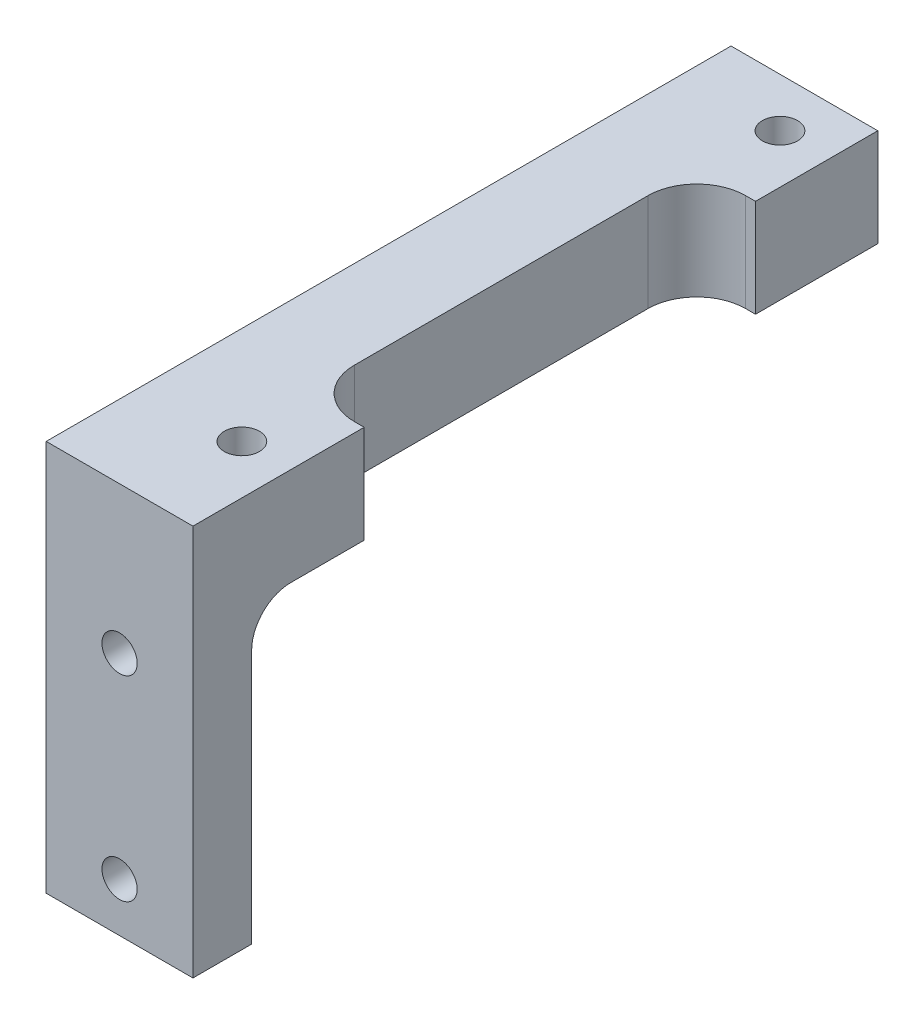
ISO-10303-21;
HEADER;
FILE_DESCRIPTION(('STEP AP214'),'2;1');
FILE_NAME('part.step','',(''),(''),'','','');
FILE_SCHEMA(('AUTOMOTIVE_DESIGN { 1 0 10303 214 1 1 1 1 }'));
ENDSEC;
DATA;
#1=APPLICATION_CONTEXT('core data for automotive mechanical design processes');
#2=APPLICATION_PROTOCOL_DEFINITION('international standard','automotive_design',2000,#1);
#3=PRODUCT_CONTEXT('',#1,'mechanical');
#4=PRODUCT('Part','Part','',(#3));
#5=PRODUCT_RELATED_PRODUCT_CATEGORY('part','',(#4));
#6=PRODUCT_DEFINITION_FORMATION('','',#4);
#7=PRODUCT_DEFINITION_CONTEXT('part definition',#1,'design');
#8=PRODUCT_DEFINITION('design','',#6,#7);
#9=PRODUCT_DEFINITION_SHAPE('','',#8);
#10=(LENGTH_UNIT() NAMED_UNIT(*) SI_UNIT(.MILLI.,.METRE.));
#11=(NAMED_UNIT(*) PLANE_ANGLE_UNIT() SI_UNIT($,.RADIAN.));
#12=(NAMED_UNIT(*) SI_UNIT($,.STERADIAN.) SOLID_ANGLE_UNIT());
#13=UNCERTAINTY_MEASURE_WITH_UNIT(LENGTH_MEASURE(1.E-05),#10,'distance_accuracy_value','');
#14=(GEOMETRIC_REPRESENTATION_CONTEXT(3) GLOBAL_UNCERTAINTY_ASSIGNED_CONTEXT((#13)) GLOBAL_UNIT_ASSIGNED_CONTEXT((#10,
#11,#12)) REPRESENTATION_CONTEXT('',''));
#15=CARTESIAN_POINT('',(0.,0.,0.));
#16=DIRECTION('',(0.,0.,1.));
#17=DIRECTION('',(1.,0.,0.));
#18=AXIS2_PLACEMENT_3D('',#15,#16,#17);
#19=CARTESIAN_POINT('',(-14.2875,-12.7,44.45));
#20=DIRECTION('',(-1.,0.,0.));
#21=DIRECTION('',(0.,0.,1.));
#22=AXIS2_PLACEMENT_3D('',#19,#20,#21);
#23=PLANE('',#22);
#24=DIRECTION('',(0.,0.,-1.));
#25=VECTOR('',#24,1.);
#26=CARTESIAN_POINT('',(-14.2875,6.35,44.45));
#27=LINE('',#26,#25);
#28=CARTESIAN_POINT('',(-14.2875,6.35,38.1));
#29=VERTEX_POINT('',#28);
#30=CARTESIAN_POINT('',(-14.2875,6.35,33.3375));
#31=VERTEX_POINT('',#30);
#32=EDGE_CURVE('E225',#29,#31,#27,.T.);
#33=ORIENTED_EDGE('',*,*,#32,.T.);
#34=DIRECTION('',(0.,1.,0.));
#35=VECTOR('',#34,1.);
#36=CARTESIAN_POINT('',(-14.2875,-12.7,33.3375));
#37=LINE('',#36,#35);
#38=CARTESIAN_POINT('',(-14.2875,12.7,33.3375));
#39=VERTEX_POINT('',#38);
#40=EDGE_CURVE('E161',#31,#39,#37,.T.);
#41=ORIENTED_EDGE('',*,*,#40,.T.);
#42=DIRECTION('',(0.,0.,1.));
#43=VECTOR('',#42,1.);
#44=CARTESIAN_POINT('',(-14.2875,12.7,44.45));
#45=LINE('',#44,#43);
#46=CARTESIAN_POINT('',(-14.2875,12.7,44.45));
#47=VERTEX_POINT('',#46);
#48=EDGE_CURVE('E180',#39,#47,#45,.T.);
#49=ORIENTED_EDGE('',*,*,#48,.T.);
#50=DIRECTION('',(0.,1.,0.));
#51=VECTOR('',#50,1.);
#52=CARTESIAN_POINT('',(-14.2875,-12.7,44.45));
#53=LINE('',#52,#51);
#54=CARTESIAN_POINT('',(-14.2875,-12.7,44.45));
#55=VERTEX_POINT('',#54);
#56=EDGE_CURVE('E189',#55,#47,#53,.T.);
#57=ORIENTED_EDGE('',*,*,#56,.F.);
#58=DIRECTION('',(0.,0.,1.));
#59=VECTOR('',#58,1.);
#60=CARTESIAN_POINT('',(-14.2875,-12.7,44.45));
#61=LINE('',#60,#59);
#62=CARTESIAN_POINT('',(-14.2875,-12.7,40.64));
#63=VERTEX_POINT('',#62);
#64=EDGE_CURVE('E179',#63,#55,#61,.T.);
#65=ORIENTED_EDGE('',*,*,#64,.F.);
#66=DIRECTION('',(0.,1.,0.));
#67=VECTOR('',#66,1.);
#68=CARTESIAN_POINT('',(-14.2875,-12.7,40.64));
#69=LINE('',#68,#67);
#70=CARTESIAN_POINT('',(-14.2875,3.81,40.64));
#71=VERTEX_POINT('',#70);
#72=EDGE_CURVE('E220',#63,#71,#69,.T.);
#73=ORIENTED_EDGE('',*,*,#72,.T.);
#74=CARTESIAN_POINT('',(-14.2875,3.81,38.1));
#75=DIRECTION('',(-1.,0.,0.));
#76=DIRECTION('',(0.,0.,1.));
#77=AXIS2_PLACEMENT_3D('',#74,#75,#76);
#78=CIRCLE('',#77,2.54);
#79=EDGE_CURVE('E242',#71,#29,#78,.T.);
#80=ORIENTED_EDGE('',*,*,#79,.T.);
#81=EDGE_LOOP('',(#33,#41,#49,#57,#65,#73,#80));
#82=FACE_BOUND('',#81,.T.);
#83=ADVANCED_FACE('F43',(#82),#23,.F.);
#84=CARTESIAN_POINT('',(-23.8125,-12.7,44.45));
#85=DIRECTION('',(1.,0.,0.));
#86=DIRECTION('',(0.,0.,-1.));
#87=AXIS2_PLACEMENT_3D('',#84,#85,#86);
#88=PLANE('',#87);
#89=DIRECTION('',(0.,-1.,0.));
#90=VECTOR('',#89,1.);
#91=CARTESIAN_POINT('',(-23.8125,-12.7,0.));
#92=LINE('',#91,#90);
#93=CARTESIAN_POINT('',(-23.8125,12.7,0.));
#94=VERTEX_POINT('',#93);
#95=CARTESIAN_POINT('',(-23.8125,6.35,0.));
#96=VERTEX_POINT('',#95);
#97=EDGE_CURVE('E200',#94,#96,#92,.T.);
#98=ORIENTED_EDGE('',*,*,#97,.T.);
#99=DIRECTION('',(0.,0.,-1.));
#100=VECTOR('',#99,1.);
#101=CARTESIAN_POINT('',(-23.8125,6.35,0.));
#102=LINE('',#101,#100);
#103=CARTESIAN_POINT('',(-23.8125,6.35,38.1));
#104=VERTEX_POINT('',#103);
#105=EDGE_CURVE('E422',#104,#96,#102,.T.);
#106=ORIENTED_EDGE('',*,*,#105,.F.);
#107=CARTESIAN_POINT('',(-23.8125,3.81,38.1));
#108=DIRECTION('',(1.,0.,0.));
#109=DIRECTION('',(0.,0.,-1.));
#110=AXIS2_PLACEMENT_3D('',#107,#108,#109);
#111=CIRCLE('',#110,2.54);
#112=CARTESIAN_POINT('',(-23.8125,3.81,40.64));
#113=VERTEX_POINT('',#112);
#114=EDGE_CURVE('E239',#104,#113,#111,.T.);
#115=ORIENTED_EDGE('',*,*,#114,.T.);
#116=DIRECTION('',(0.,1.,0.));
#117=VECTOR('',#116,1.);
#118=CARTESIAN_POINT('',(-23.8125,-12.7,40.64));
#119=LINE('',#118,#117);
#120=CARTESIAN_POINT('',(-23.8125,-12.7,40.64));
#121=VERTEX_POINT('',#120);
#122=EDGE_CURVE('E427',#121,#113,#119,.T.);
#123=ORIENTED_EDGE('',*,*,#122,.F.);
#124=DIRECTION('',(0.,0.,-1.));
#125=VECTOR('',#124,1.);
#126=CARTESIAN_POINT('',(-23.8125,-12.7,44.45));
#127=LINE('',#126,#125);
#128=CARTESIAN_POINT('',(-23.8125,-12.7,44.45));
#129=VERTEX_POINT('',#128);
#130=EDGE_CURVE('E207',#129,#121,#127,.T.);
#131=ORIENTED_EDGE('',*,*,#130,.F.);
#132=DIRECTION('',(0.,-1.,0.));
#133=VECTOR('',#132,1.);
#134=CARTESIAN_POINT('',(-23.8125,-12.7,44.45));
#135=LINE('',#134,#133);
#136=CARTESIAN_POINT('',(-23.8125,12.7,44.45));
#137=VERTEX_POINT('',#136);
#138=EDGE_CURVE('E199',#137,#129,#135,.T.);
#139=ORIENTED_EDGE('',*,*,#138,.F.);
#140=DIRECTION('',(0.,0.,-1.));
#141=VECTOR('',#140,1.);
#142=CARTESIAN_POINT('',(-23.8125,12.7,44.45));
#143=LINE('',#142,#141);
#144=EDGE_CURVE('E216',#137,#94,#143,.T.);
#145=ORIENTED_EDGE('',*,*,#144,.T.);
#146=EDGE_LOOP('',(#98,#106,#115,#123,#131,#139,#145));
#147=FACE_BOUND('',#146,.T.);
#148=ADVANCED_FACE('F287',(#147),#88,.F.);
#149=CARTESIAN_POINT('',(0.,0.,44.45));
#150=DIRECTION('',(0.,0.,-1.));
#151=DIRECTION('',(-1.,0.,0.));
#152=AXIS2_PLACEMENT_3D('',#149,#150,#151);
#153=PLANE('',#152);
#154=CARTESIAN_POINT('',(-19.05,3.175,44.45));
#155=DIRECTION('',(0.,0.,1.));
#156=DIRECTION('',(1.,0.,0.));
#157=AXIS2_PLACEMENT_3D('',#154,#155,#156);
#158=CIRCLE('',#157,1.143);
#159=CARTESIAN_POINT('',(-17.907,3.175,44.45));
#160=VERTEX_POINT('',#159);
#161=EDGE_CURVE('E438',#160,#160,#158,.T.);
#162=ORIENTED_EDGE('',*,*,#161,.F.);
#163=EDGE_LOOP('',(#162));
#164=FACE_BOUND('',#163,.T.);
#165=CARTESIAN_POINT('',(-19.05,-9.525,44.45));
#166=DIRECTION('',(0.,0.,1.));
#167=DIRECTION('',(1.,0.,0.));
#168=AXIS2_PLACEMENT_3D('',#165,#166,#167);
#169=CIRCLE('',#168,1.143);
#170=CARTESIAN_POINT('',(-17.907,-9.525,44.45));
#171=VERTEX_POINT('',#170);
#172=EDGE_CURVE('E434',#171,#171,#169,.T.);
#173=ORIENTED_EDGE('',*,*,#172,.F.);
#174=EDGE_LOOP('',(#173));
#175=FACE_BOUND('',#174,.T.);
#176=DIRECTION('',(1.,0.,0.));
#177=VECTOR('',#176,1.);
#178=CARTESIAN_POINT('',(-23.8125,-12.7,44.45));
#179=LINE('',#178,#177);
#180=EDGE_CURVE('E203',#129,#55,#179,.T.);
#181=ORIENTED_EDGE('',*,*,#180,.T.);
#182=ORIENTED_EDGE('',*,*,#56,.T.);
#183=DIRECTION('',(-1.,0.,0.));
#184=VECTOR('',#183,1.);
#185=CARTESIAN_POINT('',(-23.8125,12.7,44.45));
#186=LINE('',#185,#184);
#187=EDGE_CURVE('E196',#47,#137,#186,.T.);
#188=ORIENTED_EDGE('',*,*,#187,.T.);
#189=ORIENTED_EDGE('',*,*,#138,.T.);
#190=EDGE_LOOP('',(#181,#182,#188,#189));
#191=FACE_BOUND('',#190,.T.);
#192=ADVANCED_FACE('F283',(#164,#175,#191),#153,.F.);
#193=CARTESIAN_POINT('',(0.,0.,0.));
#194=DIRECTION('',(0.,0.,-1.));
#195=DIRECTION('',(-1.,0.,0.));
#196=AXIS2_PLACEMENT_3D('',#193,#194,#195);
#197=PLANE('',#196);
#198=DIRECTION('',(-1.,0.,0.));
#199=VECTOR('',#198,1.);
#200=CARTESIAN_POINT('',(23.8125,6.35,0.));
#201=LINE('',#200,#199);
#202=CARTESIAN_POINT('',(-14.2875,6.35,0.));
#203=VERTEX_POINT('',#202);
#204=EDGE_CURVE('E186',#203,#96,#201,.T.);
#205=ORIENTED_EDGE('',*,*,#204,.T.);
#206=ORIENTED_EDGE('',*,*,#97,.F.);
#207=DIRECTION('',(-1.,0.,0.));
#208=VECTOR('',#207,1.);
#209=CARTESIAN_POINT('',(-23.8125,12.7,0.));
#210=LINE('',#209,#208);
#211=CARTESIAN_POINT('',(-14.2875,12.7,0.));
#212=VERTEX_POINT('',#211);
#213=EDGE_CURVE('E193',#212,#94,#210,.T.);
#214=ORIENTED_EDGE('',*,*,#213,.F.);
#215=DIRECTION('',(0.,1.,0.));
#216=VECTOR('',#215,1.);
#217=CARTESIAN_POINT('',(-14.2875,-12.7,0.));
#218=LINE('',#217,#216);
#219=EDGE_CURVE('E177',#203,#212,#218,.T.);
#220=ORIENTED_EDGE('',*,*,#219,.F.);
#221=EDGE_LOOP('',(#205,#206,#214,#220));
#222=FACE_BOUND('',#221,.T.);
#223=ADVANCED_FACE('F286',(#222),#197,.T.);
#224=CARTESIAN_POINT('',(-23.8125,-12.7,44.45));
#225=DIRECTION('',(0.,1.,0.));
#226=DIRECTION('',(0.,0.,1.));
#227=AXIS2_PLACEMENT_3D('',#224,#225,#226);
#228=PLANE('',#227);
#229=ORIENTED_EDGE('',*,*,#130,.T.);
#230=DIRECTION('',(-1.,0.,0.));
#231=VECTOR('',#230,1.);
#232=CARTESIAN_POINT('',(23.8125,-12.7,40.64));
#233=LINE('',#232,#231);
#234=EDGE_CURVE('E417',#63,#121,#233,.T.);
#235=ORIENTED_EDGE('',*,*,#234,.F.);
#236=ORIENTED_EDGE('',*,*,#64,.T.);
#237=ORIENTED_EDGE('',*,*,#180,.F.);
#238=EDGE_LOOP('',(#229,#235,#236,#237));
#239=FACE_BOUND('',#238,.T.);
#240=ADVANCED_FACE('F291',(#239),#228,.F.);
#241=CARTESIAN_POINT('',(-23.8125,12.7,44.45));
#242=DIRECTION('',(0.,-1.,0.));
#243=DIRECTION('',(0.,0.,-1.));
#244=AXIS2_PLACEMENT_3D('',#241,#242,#243);
#245=PLANE('',#244);
#246=CARTESIAN_POINT('',(-17.4625,12.7,38.1));
#247=DIRECTION('',(0.,1.,0.));
#248=DIRECTION('',(0.,0.,1.));
#249=AXIS2_PLACEMENT_3D('',#246,#247,#248);
#250=CIRCLE('',#249,1.143);
#251=CARTESIAN_POINT('',(-17.4625,12.7,39.243));
#252=VERTEX_POINT('',#251);
#253=EDGE_CURVE('E445',#252,#252,#250,.T.);
#254=ORIENTED_EDGE('',*,*,#253,.F.);
#255=EDGE_LOOP('',(#254));
#256=FACE_BOUND('',#255,.T.);
#257=CARTESIAN_POINT('',(-17.4625,12.7,3.175));
#258=DIRECTION('',(0.,1.,0.));
#259=DIRECTION('',(0.,0.,1.));
#260=AXIS2_PLACEMENT_3D('',#257,#258,#259);
#261=CIRCLE('',#260,1.143);
#262=CARTESIAN_POINT('',(-17.4625,12.7,4.318));
#263=VERTEX_POINT('',#262);
#264=EDGE_CURVE('E446',#263,#263,#261,.T.);
#265=ORIENTED_EDGE('',*,*,#264,.F.);
#266=EDGE_LOOP('',(#265));
#267=FACE_BOUND('',#266,.T.);
#268=ORIENTED_EDGE('',*,*,#48,.F.);
#269=DIRECTION('',(1.,0.,0.));
#270=VECTOR('',#269,1.);
#271=CARTESIAN_POINT('',(-18.0975,12.7,33.3375));
#272=LINE('',#271,#270);
#273=CARTESIAN_POINT('',(-14.9225,12.7,33.3375));
#274=VERTEX_POINT('',#273);
#275=EDGE_CURVE('E162',#274,#39,#272,.T.);
#276=ORIENTED_EDGE('',*,*,#275,.F.);
#277=CARTESIAN_POINT('',(-14.9225,12.7,30.1625));
#278=DIRECTION('',(0.,-1.,0.));
#279=DIRECTION('',(0.,0.,-1.));
#280=AXIS2_PLACEMENT_3D('',#277,#278,#279);
#281=CIRCLE('',#280,3.175);
#282=CARTESIAN_POINT('',(-18.0975,12.7,30.1625));
#283=VERTEX_POINT('',#282);
#284=EDGE_CURVE('E52',#274,#283,#281,.T.);
#285=ORIENTED_EDGE('',*,*,#284,.T.);
#286=DIRECTION('',(0.,0.,1.));
#287=VECTOR('',#286,1.);
#288=CARTESIAN_POINT('',(-18.0975,12.7,33.3375));
#289=LINE('',#288,#287);
#290=CARTESIAN_POINT('',(-18.0975,12.7,11.1125));
#291=VERTEX_POINT('',#290);
#292=EDGE_CURVE('E173',#291,#283,#289,.T.);
#293=ORIENTED_EDGE('',*,*,#292,.F.);
#294=CARTESIAN_POINT('',(-14.9225,12.7,11.1125));
#295=DIRECTION('',(0.,-1.,0.));
#296=DIRECTION('',(0.,0.,-1.));
#297=AXIS2_PLACEMENT_3D('',#294,#295,#296);
#298=CIRCLE('',#297,3.175);
#299=CARTESIAN_POINT('',(-14.9225,12.7,7.9375));
#300=VERTEX_POINT('',#299);
#301=EDGE_CURVE('E171',#291,#300,#298,.T.);
#302=ORIENTED_EDGE('',*,*,#301,.T.);
#303=DIRECTION('',(-1.,0.,0.));
#304=VECTOR('',#303,1.);
#305=CARTESIAN_POINT('',(-18.0975,12.7,7.9375));
#306=LINE('',#305,#304);
#307=CARTESIAN_POINT('',(-14.2875,12.7,7.9375));
#308=VERTEX_POINT('',#307);
#309=EDGE_CURVE('E153',#308,#300,#306,.T.);
#310=ORIENTED_EDGE('',*,*,#309,.F.);
#311=EDGE_CURVE('E168',#212,#308,#45,.T.);
#312=ORIENTED_EDGE('',*,*,#311,.F.);
#313=ORIENTED_EDGE('',*,*,#213,.T.);
#314=ORIENTED_EDGE('',*,*,#144,.F.);
#315=ORIENTED_EDGE('',*,*,#187,.F.);
#316=EDGE_LOOP('',(#268,#276,#285,#293,#302,#310,#312,#313,#314,#315));
#317=FACE_BOUND('',#316,.T.);
#318=ADVANCED_FACE('F167',(#256,#267,#317),#245,.F.);
#319=ORIENTED_EDGE('',*,*,#311,.T.);
#320=DIRECTION('',(0.,-1.,0.));
#321=VECTOR('',#320,1.);
#322=CARTESIAN_POINT('',(-14.2875,-12.7,7.9375));
#323=LINE('',#322,#321);
#324=CARTESIAN_POINT('',(-14.2875,6.35,7.9375));
#325=VERTEX_POINT('',#324);
#326=EDGE_CURVE('E150',#308,#325,#323,.T.);
#327=ORIENTED_EDGE('',*,*,#326,.T.);
#328=EDGE_CURVE('E224',#325,#203,#27,.T.);
#329=ORIENTED_EDGE('',*,*,#328,.T.);
#330=ORIENTED_EDGE('',*,*,#219,.T.);
#331=EDGE_LOOP('',(#319,#327,#329,#330));
#332=FACE_BOUND('',#331,.T.);
#333=ADVANCED_FACE('F175',(#332),#23,.F.);
#334=CARTESIAN_POINT('',(23.8125,6.35,0.));
#335=DIRECTION('',(0.,1.,0.));
#336=DIRECTION('',(0.,0.,1.));
#337=AXIS2_PLACEMENT_3D('',#334,#335,#336);
#338=PLANE('',#337);
#339=CARTESIAN_POINT('',(-17.4625,6.35,3.175));
#340=DIRECTION('',(0.,1.,0.));
#341=DIRECTION('',(0.,0.,1.));
#342=AXIS2_PLACEMENT_3D('',#339,#340,#341);
#343=CIRCLE('',#342,1.143);
#344=CARTESIAN_POINT('',(-17.4625,6.35,4.318));
#345=VERTEX_POINT('',#344);
#346=EDGE_CURVE('E331',#345,#345,#343,.T.);
#347=ORIENTED_EDGE('',*,*,#346,.T.);
#348=EDGE_LOOP('',(#347));
#349=FACE_BOUND('',#348,.T.);
#350=DIRECTION('',(-1.,0.,0.));
#351=VECTOR('',#350,1.);
#352=CARTESIAN_POINT('',(23.8125,6.35,7.9375));
#353=LINE('',#352,#351);
#354=CARTESIAN_POINT('',(-14.9225,6.35,7.9375));
#355=VERTEX_POINT('',#354);
#356=EDGE_CURVE('E156',#325,#355,#353,.T.);
#357=ORIENTED_EDGE('',*,*,#356,.T.);
#358=CARTESIAN_POINT('',(-14.9225,6.35,11.1125));
#359=DIRECTION('',(0.,1.,0.));
#360=DIRECTION('',(0.,0.,1.));
#361=AXIS2_PLACEMENT_3D('',#358,#359,#360);
#362=CIRCLE('',#361,3.175);
#363=CARTESIAN_POINT('',(-18.0975,6.35,11.1125));
#364=VERTEX_POINT('',#363);
#365=EDGE_CURVE('E361',#355,#364,#362,.T.);
#366=ORIENTED_EDGE('',*,*,#365,.T.);
#367=DIRECTION('',(0.,0.,1.));
#368=VECTOR('',#367,1.);
#369=CARTESIAN_POINT('',(-18.0975,6.35,0.));
#370=LINE('',#369,#368);
#371=CARTESIAN_POINT('',(-18.0975,6.35,30.1625));
#372=VERTEX_POINT('',#371);
#373=EDGE_CURVE('E324',#364,#372,#370,.T.);
#374=ORIENTED_EDGE('',*,*,#373,.T.);
#375=CARTESIAN_POINT('',(-14.9225,6.35,30.1625));
#376=DIRECTION('',(0.,1.,0.));
#377=DIRECTION('',(0.,0.,1.));
#378=AXIS2_PLACEMENT_3D('',#375,#376,#377);
#379=CIRCLE('',#378,3.175);
#380=CARTESIAN_POINT('',(-14.9225,6.35,33.3375));
#381=VERTEX_POINT('',#380);
#382=EDGE_CURVE('E11',#372,#381,#379,.T.);
#383=ORIENTED_EDGE('',*,*,#382,.T.);
#384=DIRECTION('',(1.,0.,0.));
#385=VECTOR('',#384,1.);
#386=CARTESIAN_POINT('',(23.8125,6.35,33.3375));
#387=LINE('',#386,#385);
#388=EDGE_CURVE('E314',#381,#31,#387,.T.);
#389=ORIENTED_EDGE('',*,*,#388,.T.);
#390=ORIENTED_EDGE('',*,*,#32,.F.);
#391=DIRECTION('',(-1.,0.,0.));
#392=VECTOR('',#391,1.);
#393=CARTESIAN_POINT('',(-23.8125,6.35,38.1));
#394=LINE('',#393,#392);
#395=CARTESIAN_POINT('',(-16.3195,6.35,38.1));
#396=VERTEX_POINT('',#395);
#397=EDGE_CURVE('E230',#29,#396,#394,.T.);
#398=ORIENTED_EDGE('',*,*,#397,.T.);
#399=CARTESIAN_POINT('',(-17.4625,6.35,38.1));
#400=DIRECTION('',(0.,1.,0.));
#401=DIRECTION('',(0.,0.,1.));
#402=AXIS2_PLACEMENT_3D('',#399,#400,#401);
#403=CIRCLE('',#402,1.143);
#404=CARTESIAN_POINT('',(-18.6055,6.35,38.1));
#405=VERTEX_POINT('',#404);
#406=EDGE_CURVE('E442',#396,#405,#403,.T.);
#407=ORIENTED_EDGE('',*,*,#406,.T.);
#408=EDGE_CURVE('E229',#405,#104,#394,.T.);
#409=ORIENTED_EDGE('',*,*,#408,.T.);
#410=ORIENTED_EDGE('',*,*,#105,.T.);
#411=ORIENTED_EDGE('',*,*,#204,.F.);
#412=ORIENTED_EDGE('',*,*,#328,.F.);
#413=EDGE_LOOP('',(#357,#366,#374,#383,#389,#390,#398,#407,#409,#410,#411,#412));
#414=FACE_BOUND('',#413,.T.);
#415=ADVANCED_FACE('F273',(#349,#414),#338,.F.);
#416=CARTESIAN_POINT('',(23.8125,-12.7,40.64));
#417=DIRECTION('',(0.,0.,1.));
#418=DIRECTION('',(1.,0.,0.));
#419=AXIS2_PLACEMENT_3D('',#416,#417,#418);
#420=PLANE('',#419);
#421=CARTESIAN_POINT('',(-19.05,-9.525,40.64));
#422=DIRECTION('',(0.,0.,1.));
#423=DIRECTION('',(1.,0.,0.));
#424=AXIS2_PLACEMENT_3D('',#421,#422,#423);
#425=CIRCLE('',#424,1.143);
#426=CARTESIAN_POINT('',(-17.907,-9.525,40.64));
#427=VERTEX_POINT('',#426);
#428=EDGE_CURVE('E255',#427,#427,#425,.T.);
#429=ORIENTED_EDGE('',*,*,#428,.T.);
#430=EDGE_LOOP('',(#429));
#431=FACE_BOUND('',#430,.T.);
#432=DIRECTION('',(-1.,0.,0.));
#433=VECTOR('',#432,1.);
#434=CARTESIAN_POINT('',(-14.2875,3.81,40.64));
#435=LINE('',#434,#433);
#436=CARTESIAN_POINT('',(-20.0003809762406,3.81,40.64));
#437=VERTEX_POINT('',#436);
#438=EDGE_CURVE('E235',#113,#437,#435,.F.);
#439=ORIENTED_EDGE('',*,*,#438,.T.);
#440=CARTESIAN_POINT('',(-19.05,3.175,40.64));
#441=DIRECTION('',(0.,0.,1.));
#442=DIRECTION('',(1.,0.,0.));
#443=AXIS2_PLACEMENT_3D('',#440,#441,#442);
#444=CIRCLE('',#443,1.143);
#445=CARTESIAN_POINT('',(-18.0996190237594,3.81,40.64));
#446=VERTEX_POINT('',#445);
#447=EDGE_CURVE('E413',#437,#446,#444,.T.);
#448=ORIENTED_EDGE('',*,*,#447,.T.);
#449=EDGE_CURVE('E234',#446,#71,#435,.F.);
#450=ORIENTED_EDGE('',*,*,#449,.T.);
#451=ORIENTED_EDGE('',*,*,#72,.F.);
#452=ORIENTED_EDGE('',*,*,#234,.T.);
#453=ORIENTED_EDGE('',*,*,#122,.T.);
#454=EDGE_LOOP('',(#439,#448,#450,#451,#452,#453));
#455=FACE_BOUND('',#454,.T.);
#456=ADVANCED_FACE('F276',(#431,#455),#420,.F.);
#457=CARTESIAN_POINT('',(23.8125,3.81,38.1));
#458=DIRECTION('',(1.,0.,0.));
#459=DIRECTION('',(0.,0.,-1.));
#460=AXIS2_PLACEMENT_3D('',#457,#458,#459);
#461=CYLINDRICAL_SURFACE('',#460,2.54);
#462=ORIENTED_EDGE('',*,*,#408,.F.);
#463=CARTESIAN_POINT('',(-18.6055,6.35,38.1));
#464=CARTESIAN_POINT('',(-18.6055013342635,6.35000288838612,38.1305342874342));
#465=CARTESIAN_POINT('',(-18.6042756298034,6.34944878170208,38.161052614258));
#466=CARTESIAN_POINT('',(-18.5993960218299,6.34725767992865,38.2218449090373));
#467=CARTESIAN_POINT('',(-18.5957429648243,6.3456210623518,38.2521189584575));
#468=CARTESIAN_POINT('',(-18.5812273670935,6.33915445348556,38.3419965938371));
#469=CARTESIAN_POINT('',(-18.5668078059528,6.33276708519985,38.4009557620108));
#470=CARTESIAN_POINT('',(-18.5290772016595,6.31648193532009,38.5153223070017));
#471=CARTESIAN_POINT('',(-18.505774245939,6.30658734726825,38.5707328610386));
#472=CARTESIAN_POINT('',(-18.4510545822422,6.28422067546021,38.676868025954));
#473=CARTESIAN_POINT('',(-18.4196308278494,6.27174635515778,38.7275885151066));
#474=CARTESIAN_POINT('',(-18.3477236426565,6.24466777116817,38.825753786401));
#475=CARTESIAN_POINT('',(-18.3068583627237,6.22998710121369,38.8728973559971));
#476=CARTESIAN_POINT('',(-18.2180419890188,6.20044792518947,38.9599268436103));
#477=CARTESIAN_POINT('',(-18.1700873597357,6.18558933380653,38.9998091180913));
#478=CARTESIAN_POINT('',(-18.0649981826244,6.15637213033484,39.0735529532226));
#479=CARTESIAN_POINT('',(-18.0074867774595,6.14209614742484,39.1069137724005));
#480=CARTESIAN_POINT('',(-17.8869420393431,6.11691195936876,39.1633528232744));
#481=CARTESIAN_POINT('',(-17.8239121548863,6.10600167001582,39.1864374224631));
#482=CARTESIAN_POINT('',(-17.6976065181027,6.08963227597976,39.2203644659886));
#483=CARTESIAN_POINT('',(-17.634523987941,6.08391296879384,39.2317953174589));
#484=CARTESIAN_POINT('',(-17.5070959866828,6.07784089926286,39.2439181519987));
#485=CARTESIAN_POINT('',(-17.4427513938256,6.07748452898433,39.2446173548265));
#486=CARTESIAN_POINT('',(-17.3209798031485,6.08196252477118,39.235694483485));
#487=CARTESIAN_POINT('',(-17.2634622042883,6.08632110856437,39.2270185363571));
#488=CARTESIAN_POINT('',(-17.1508094300755,6.09892230998189,39.2011988087691));
#489=CARTESIAN_POINT('',(-17.0956747640458,6.10716575350963,39.1840532276662));
#490=CARTESIAN_POINT('',(-16.9878565023729,6.12679913028329,39.141441574238));
#491=CARTESIAN_POINT('',(-16.9352566077941,6.13825604583392,39.115795992869));
#492=CARTESIAN_POINT('',(-16.8348801067498,6.16301655934816,39.0570412519714));
#493=CARTESIAN_POINT('',(-16.7871056620204,6.17632097868587,39.0239287686557));
#494=CARTESIAN_POINT('',(-16.6927039303712,6.20489320787105,38.9473007724596));
#495=CARTESIAN_POINT('',(-16.646669930455,6.22022425863122,38.903075789693));
#496=CARTESIAN_POINT('',(-16.5624498842018,6.25001788123482,38.8074046603163));
#497=CARTESIAN_POINT('',(-16.5242669841751,6.26448010326015,38.7559556325322));
#498=CARTESIAN_POINT('',(-16.4557468872394,6.29146701855131,38.6452225222841));
#499=CARTESIAN_POINT('',(-16.425694217434,6.30391646832275,38.5857429099058));
#500=CARTESIAN_POINT('',(-16.3762647527544,6.3248665401722,38.4618966557652));
#501=CARTESIAN_POINT('',(-16.3568704774535,6.3333736243595,38.3975382140889));
#502=CARTESIAN_POINT('',(-16.3353789768288,6.34288477846016,38.2938015683215));
#503=CARTESIAN_POINT('',(-16.3294365654883,6.34554001964567,38.2553316677414));
#504=CARTESIAN_POINT('',(-16.3214941447408,6.3491023452927,38.1779168358743));
#505=CARTESIAN_POINT('',(-16.3194932474643,6.35000982345608,38.1389720135579));
#506=CARTESIAN_POINT('',(-16.3195,6.35,38.1));
#507=B_SPLINE_CURVE_WITH_KNOTS('',3,(#463,#464,#465,#466,#467,#468,#469,#470,#471,#472,#473,
#474,#475,#476,#477,#478,#479,#480,#481,#482,#483,#484,#485,#486,#487,#488,#489,#490,#491,#492,
#493,#494,#495,#496,#497,#498,#499,#500,#501,#502,#503,#504,#505,#506),.UNSPECIFIED.,.F.,.F.,(4,
2,2,2,2,2,2,2,2,2,2,2,2,2,2,2,2,2,2,2,2,4),(0.,0.0915422680688189,0.183052628702821,
0.365185330438426,0.54715261323738,0.72927832229802,0.920740381310048,1.11229824800258,
1.31527720707648,1.51813021787046,1.71014043626755,1.90202147337851,2.07620262383167,
2.25042082111694,2.4285815039115,2.60682164954432,2.80289957475028,2.9990559252422,
3.20138164062741,3.40337453144015,3.52020390858844,3.63700696561964),.UNSPECIFIED.);
#508=EDGE_CURVE('E254',#405,#396,#507,.T.);
#509=ORIENTED_EDGE('',*,*,#508,.T.);
#510=ORIENTED_EDGE('',*,*,#397,.F.);
#511=ORIENTED_EDGE('',*,*,#79,.F.);
#512=ORIENTED_EDGE('',*,*,#449,.F.);
#513=CARTESIAN_POINT('',(-17.907,3.175,40.5593444248417));
#514=CARTESIAN_POINT('',(-17.9070023360911,3.23308586850009,40.5743402416249));
#515=CARTESIAN_POINT('',(-17.9114453672256,3.29173632925226,40.5872714228735));
#516=CARTESIAN_POINT('',(-17.929535112107,3.40844477753045,40.6087603231855));
#517=CARTESIAN_POINT('',(-17.9431857328253,3.46650250292629,40.6173161829985));
#518=CARTESIAN_POINT('',(-17.979564122067,3.58018810678425,40.6302293931123));
#519=CARTESIAN_POINT('',(-18.0022916274761,3.63581605562718,40.6345868651006));
#520=CARTESIAN_POINT('',(-18.0562730743017,3.74293946615986,40.6396816639595));
#521=CARTESIAN_POINT('',(-18.0875279854664,3.79443445698147,40.6404185789141));
#522=CARTESIAN_POINT('',(-18.1578086437539,3.89198606717604,40.6391471855582));
#523=CARTESIAN_POINT('',(-18.1968565556624,3.93802656365968,40.6371309489478));
#524=CARTESIAN_POINT('',(-18.2816400038699,4.02334632727285,40.6313860483373));
#525=CARTESIAN_POINT('',(-18.3273771750139,4.06262393643899,40.6276569652417));
#526=CARTESIAN_POINT('',(-18.4268921091424,4.1352976256996,40.6193629783194));
#527=CARTESIAN_POINT('',(-18.480960759575,4.16829223151398,40.6147651767032));
#528=CARTESIAN_POINT('',(-18.5938329412263,4.22492778703552,40.6060445991589));
#529=CARTESIAN_POINT('',(-18.6526368666375,4.24856795705346,40.6019218628476));
#530=CARTESIAN_POINT('',(-18.7745735157243,4.28618637659287,40.595039692646));
#531=CARTESIAN_POINT('',(-18.8377671573293,4.29997302417657,40.5923075765992));
#532=CARTESIAN_POINT('',(-18.9656243115717,4.31670281933584,40.588961063246));
#533=CARTESIAN_POINT('',(-19.0302876000295,4.31964760970231,40.5883463451059));
#534=CARTESIAN_POINT('',(-19.157948473376,4.31464918374396,40.5893641805289));
#535=CARTESIAN_POINT('',(-19.2209545002002,4.30690988380667,40.590954648442));
#536=CARTESIAN_POINT('',(-19.3447537530927,4.28114995073691,40.5959542305618));
#537=CARTESIAN_POINT('',(-19.4055467654091,4.26312832723775,40.5993635199507));
#538=CARTESIAN_POINT('',(-19.5234409549433,4.21726492302863,40.6072444573604));
#539=CARTESIAN_POINT('',(-19.5805304046953,4.18939359318974,40.6117192886839));
#540=CARTESIAN_POINT('',(-19.6893251216355,4.12459063479307,40.6206544942098));
#541=CARTESIAN_POINT('',(-19.7410294666688,4.08765745809027,40.62511486581));
#542=CARTESIAN_POINT('',(-19.8385032191528,4.00497852476028,40.6328506924286));
#543=CARTESIAN_POINT('',(-19.8841558879251,3.9590927429366,40.6361045581336));
#544=CARTESIAN_POINT('',(-19.967113369892,3.86021048930232,40.6399843130126));
#545=CARTESIAN_POINT('',(-20.004420471036,3.80721597275043,40.6406109232903));
#546=CARTESIAN_POINT('',(-20.0685934086522,3.69734701231416,40.6380775949307));
#547=CARTESIAN_POINT('',(-20.095727924887,3.64062736077522,40.6350256988775));
#548=CARTESIAN_POINT('',(-20.1402441264153,3.52387825523894,40.6245123112393));
#549=CARTESIAN_POINT('',(-20.1576296042776,3.46385009831071,40.6170525367288));
#550=CARTESIAN_POINT('',(-20.1817632282019,3.34541459292632,40.5978369424645));
#551=CARTESIAN_POINT('',(-20.1889763517694,3.287065209603,40.5863014203943));
#552=CARTESIAN_POINT('',(-20.194470550712,3.17094518168283,40.5590175935416));
#553=CARTESIAN_POINT('',(-20.1927504620182,3.11317461349298,40.543268739982));
#554=CARTESIAN_POINT('',(-20.180787614682,2.99845113424185,40.5076290032287));
#555=CARTESIAN_POINT('',(-20.1703579932143,2.94154425082015,40.4876545375567));
#556=CARTESIAN_POINT('',(-20.1415253403113,2.83107535347666,40.4445316038175));
#557=CARTESIAN_POINT('',(-20.1231202216697,2.77751421934638,40.421382305974));
#558=CARTESIAN_POINT('',(-20.0766519171773,2.66871956111925,40.3700424746317));
#559=CARTESIAN_POINT('',(-20.047731467071,2.61398272256405,40.3415779073439));
#560=CARTESIAN_POINT('',(-19.9819207396611,2.51035893401114,40.2831355808679));
#561=CARTESIAN_POINT('',(-19.9450203672498,2.46147951688158,40.2531559421738));
#562=CARTESIAN_POINT('',(-19.858350710358,2.36392404503734,40.1890940807108));
#563=CARTESIAN_POINT('',(-19.8075108285092,2.31619395701816,40.1550126999479));
#564=CARTESIAN_POINT('',(-19.6969112495825,2.23008914650886,40.0895718841766));
#565=CARTESIAN_POINT('',(-19.6371616535708,2.19170395766541,40.0582094295485));
#566=CARTESIAN_POINT('',(-19.528068600125,2.13554238768796,40.0101661185134));
#567=CARTESIAN_POINT('',(-19.4808449129719,2.11502605402651,39.9918819539634));
#568=CARTESIAN_POINT('',(-19.3826309423331,2.08023483411362,39.9601257793608));
#569=CARTESIAN_POINT('',(-19.3316463079045,2.06595080126026,39.9466467226279));
#570=CARTESIAN_POINT('',(-19.2263312809086,2.04439460486004,39.9260532141637));
#571=CARTESIAN_POINT('',(-19.171971566237,2.03719703999826,39.9190065306668));
#572=CARTESIAN_POINT('',(-19.062345118284,2.03075233803165,39.9127060639461));
#573=CARTESIAN_POINT('',(-19.007079215701,2.03149828595746,39.913445502758));
#574=CARTESIAN_POINT('',(-18.9059378799531,2.04014818185709,39.9218799556948));
#575=CARTESIAN_POINT('',(-18.8598741785085,2.04698606027107,39.928538734319));
#576=CARTESIAN_POINT('',(-18.7698005889694,2.06591980208569,39.9466062571074));
#577=CARTESIAN_POINT('',(-18.7257926809764,2.0780206235498,39.9580194798644));
#578=CARTESIAN_POINT('',(-18.6248956610472,2.11221057894774,39.9893975524593));
#579=CARTESIAN_POINT('',(-18.5691989497261,2.1363351420632,40.0109635440476));
#580=CARTESIAN_POINT('',(-18.463662622308,2.1920289823021,40.0583430170325));
#581=CARTESIAN_POINT('',(-18.413832198172,2.22360971590151,40.0841630161173));
#582=CARTESIAN_POINT('',(-18.3192627888429,2.2940780161731,40.1385300560779));
#583=CARTESIAN_POINT('',(-18.2746611330801,2.33311202086687,40.1671248560699));
#584=CARTESIAN_POINT('',(-18.1921279773694,2.41738237083939,40.2248123532537));
#585=CARTESIAN_POINT('',(-18.1541992747515,2.46262130317486,40.2539052536703));
#586=CARTESIAN_POINT('',(-18.0785503615889,2.56854775781109,40.3169620510936));
#587=CARTESIAN_POINT('',(-18.0424227241891,2.63050945209595,40.3507215349086));
#588=CARTESIAN_POINT('',(-17.981958465529,2.76157477702854,40.414669072882));
#589=CARTESIAN_POINT('',(-17.9576012399897,2.83066566865163,40.4448632975266));
#590=CARTESIAN_POINT('',(-17.9292147263105,2.94624257061454,40.4890874159703));
#591=CARTESIAN_POINT('',(-17.9209635801226,2.9910658431365,40.5048359474772));
#592=CARTESIAN_POINT('',(-17.9098559213784,3.08213844506948,40.5339472701961));
#593=CARTESIAN_POINT('',(-17.9069981253409,3.12838743253306,40.5473106283336));
#594=CARTESIAN_POINT('',(-17.907,3.175,40.5593444248417));
#595=B_SPLINE_CURVE_WITH_KNOTS('',3,(#513,#514,#515,#516,#517,#518,#519,#520,#521,#522,#523,
#524,#525,#526,#527,#528,#529,#530,#531,#532,#533,#534,#535,#536,#537,#538,#539,#540,#541,#542,
#543,#544,#545,#546,#547,#548,#549,#550,#551,#552,#553,#554,#555,#556,#557,#558,#559,#560,#561,
#562,#563,#564,#565,#566,#567,#568,#569,#570,#571,#572,#573,#574,#575,#576,#577,#578,#579,#580,
#581,#582,#583,#584,#585,#586,#587,#588,#589,#590,#591,#592,#593,#594),.UNSPECIFIED.,.T.,.F.,(4,
2,2,2,2,2,2,2,2,2,2,2,2,2,2,2,2,2,2,2,2,2,2,2,2,2,2,2,2,2,2,2,2,2,2,2,2,2,2,2,4),(0.,
0.179804349596565,0.359685041947603,0.539560520422147,0.719456463115286,0.899871549358786,
1.08033080268812,1.26998170754804,1.45964841642164,1.65290965614457,1.8461416111364,
2.03573609581329,2.22534884482197,2.41553532981919,2.6057543293283,2.79922934222237,
2.99265124848111,3.18052788890915,3.36833139081426,3.54723657969335,3.72616508193336,
3.90903417592512,4.09195115611776,4.29556829830812,4.49944455187856,4.73126217080685,
4.96281894539416,5.12616094813151,5.28926241509563,5.45406304451613,5.61872022378941,
5.75922359014577,5.89985960826497,6.09205411489078,6.28454587440523,6.4813041250495,
6.6781446620541,6.91478264715375,7.1510048797734,7.2953280657702,7.43961690215743),.UNSPECIFIED.);
#596=EDGE_CURVE('E245',#446,#437,#595,.T.);
#597=ORIENTED_EDGE('',*,*,#596,.T.);
#598=ORIENTED_EDGE('',*,*,#438,.F.);
#599=ORIENTED_EDGE('',*,*,#114,.F.);
#600=EDGE_LOOP('',(#462,#509,#510,#511,#512,#597,#598,#599));
#601=FACE_BOUND('',#600,.T.);
#602=ADVANCED_FACE('F257',(#601),#461,.F.);
#603=CARTESIAN_POINT('',(-19.05,3.175,0.));
#604=DIRECTION('',(0.,0.,1.));
#605=DIRECTION('',(1.,0.,0.));
#606=AXIS2_PLACEMENT_3D('',#603,#604,#605);
#607=CYLINDRICAL_SURFACE('',#606,1.143);
#608=ORIENTED_EDGE('',*,*,#161,.T.);
#609=EDGE_LOOP('',(#608));
#610=FACE_BOUND('',#609,.T.);
#611=ORIENTED_EDGE('',*,*,#596,.F.);
#612=ORIENTED_EDGE('',*,*,#447,.F.);
#613=EDGE_LOOP('',(#611,#612));
#614=FACE_BOUND('',#613,.T.);
#615=ADVANCED_FACE('F260',(#610,#614),#607,.F.);
#616=CARTESIAN_POINT('',(-19.05,-9.525,0.));
#617=DIRECTION('',(0.,0.,1.));
#618=DIRECTION('',(1.,0.,0.));
#619=AXIS2_PLACEMENT_3D('',#616,#617,#618);
#620=CYLINDRICAL_SURFACE('',#619,1.143);
#621=ORIENTED_EDGE('',*,*,#172,.T.);
#622=EDGE_LOOP('',(#621));
#623=FACE_BOUND('',#622,.T.);
#624=ORIENTED_EDGE('',*,*,#428,.F.);
#625=EDGE_LOOP('',(#624));
#626=FACE_BOUND('',#625,.T.);
#627=ADVANCED_FACE('F265',(#623,#626),#620,.F.);
#628=CARTESIAN_POINT('',(-17.4625,2.54,38.1));
#629=DIRECTION('',(0.,1.,0.));
#630=DIRECTION('',(0.,0.,1.));
#631=AXIS2_PLACEMENT_3D('',#628,#629,#630);
#632=CYLINDRICAL_SURFACE('',#631,1.143);
#633=ORIENTED_EDGE('',*,*,#253,.T.);
#634=EDGE_LOOP('',(#633));
#635=FACE_BOUND('',#634,.T.);
#636=ORIENTED_EDGE('',*,*,#508,.F.);
#637=ORIENTED_EDGE('',*,*,#406,.F.);
#638=EDGE_LOOP('',(#636,#637));
#639=FACE_BOUND('',#638,.T.);
#640=ADVANCED_FACE('F271',(#635,#639),#632,.F.);
#641=CARTESIAN_POINT('',(-17.4625,2.54,3.175));
#642=DIRECTION('',(0.,1.,0.));
#643=DIRECTION('',(0.,0.,1.));
#644=AXIS2_PLACEMENT_3D('',#641,#642,#643);
#645=CYLINDRICAL_SURFACE('',#644,1.143);
#646=ORIENTED_EDGE('',*,*,#264,.T.);
#647=EDGE_LOOP('',(#646));
#648=FACE_BOUND('',#647,.T.);
#649=ORIENTED_EDGE('',*,*,#346,.F.);
#650=EDGE_LOOP('',(#649));
#651=FACE_BOUND('',#650,.T.);
#652=ADVANCED_FACE('F267',(#648,#651),#645,.F.);
#653=CARTESIAN_POINT('',(-18.0975,-12.7,33.3375));
#654=DIRECTION('',(0.,0.,1.));
#655=DIRECTION('',(1.,0.,0.));
#656=AXIS2_PLACEMENT_3D('',#653,#654,#655);
#657=PLANE('',#656);
#658=ORIENTED_EDGE('',*,*,#388,.F.);
#659=DIRECTION('',(0.,1.,0.));
#660=VECTOR('',#659,1.);
#661=CARTESIAN_POINT('',(-14.9225,12.7,33.3375));
#662=LINE('',#661,#660);
#663=EDGE_CURVE('E350',#381,#274,#662,.T.);
#664=ORIENTED_EDGE('',*,*,#663,.T.);
#665=ORIENTED_EDGE('',*,*,#275,.T.);
#666=ORIENTED_EDGE('',*,*,#40,.F.);
#667=EDGE_LOOP('',(#658,#664,#665,#666));
#668=FACE_BOUND('',#667,.T.);
#669=ADVANCED_FACE('F342',(#668),#657,.F.);
#670=CARTESIAN_POINT('',(-18.0975,-12.7,33.3375));
#671=DIRECTION('',(-1.,0.,0.));
#672=DIRECTION('',(0.,0.,1.));
#673=AXIS2_PLACEMENT_3D('',#670,#671,#672);
#674=PLANE('',#673);
#675=ORIENTED_EDGE('',*,*,#373,.F.);
#676=DIRECTION('',(0.,1.,0.));
#677=VECTOR('',#676,1.);
#678=CARTESIAN_POINT('',(-18.0975,12.7,11.1125));
#679=LINE('',#678,#677);
#680=EDGE_CURVE('E363',#364,#291,#679,.T.);
#681=ORIENTED_EDGE('',*,*,#680,.T.);
#682=ORIENTED_EDGE('',*,*,#292,.T.);
#683=DIRECTION('',(0.,1.,0.));
#684=VECTOR('',#683,1.);
#685=CARTESIAN_POINT('',(-18.0975,6.35,30.1625));
#686=LINE('',#685,#684);
#687=EDGE_CURVE('E353',#283,#372,#686,.F.);
#688=ORIENTED_EDGE('',*,*,#687,.T.);
#689=EDGE_LOOP('',(#675,#681,#682,#688));
#690=FACE_BOUND('',#689,.T.);
#691=ADVANCED_FACE('F339',(#690),#674,.F.);
#692=CARTESIAN_POINT('',(-18.0975,-12.7,7.9375));
#693=DIRECTION('',(0.,0.,-1.));
#694=DIRECTION('',(-1.,0.,0.));
#695=AXIS2_PLACEMENT_3D('',#692,#693,#694);
#696=PLANE('',#695);
#697=ORIENTED_EDGE('',*,*,#309,.T.);
#698=DIRECTION('',(0.,1.,0.));
#699=VECTOR('',#698,1.);
#700=CARTESIAN_POINT('',(-14.9225,6.35,7.9375));
#701=LINE('',#700,#699);
#702=EDGE_CURVE('E356',#300,#355,#701,.F.);
#703=ORIENTED_EDGE('',*,*,#702,.T.);
#704=ORIENTED_EDGE('',*,*,#356,.F.);
#705=ORIENTED_EDGE('',*,*,#326,.F.);
#706=EDGE_LOOP('',(#697,#703,#704,#705));
#707=FACE_BOUND('',#706,.T.);
#708=ADVANCED_FACE('F152',(#707),#696,.F.);
#709=CARTESIAN_POINT('',(-14.9225,-12.7,11.1125));
#710=DIRECTION('',(0.,-1.,0.));
#711=DIRECTION('',(0.,0.,-1.));
#712=AXIS2_PLACEMENT_3D('',#709,#710,#711);
#713=CYLINDRICAL_SURFACE('',#712,3.175);
#714=ORIENTED_EDGE('',*,*,#365,.F.);
#715=ORIENTED_EDGE('',*,*,#702,.F.);
#716=ORIENTED_EDGE('',*,*,#301,.F.);
#717=ORIENTED_EDGE('',*,*,#680,.F.);
#718=EDGE_LOOP('',(#714,#715,#716,#717));
#719=FACE_BOUND('',#718,.T.);
#720=ADVANCED_FACE('F338',(#719),#713,.F.);
#721=CARTESIAN_POINT('',(-14.9225,-12.7,30.1625));
#722=DIRECTION('',(0.,-1.,0.));
#723=DIRECTION('',(0.,0.,-1.));
#724=AXIS2_PLACEMENT_3D('',#721,#722,#723);
#725=CYLINDRICAL_SURFACE('',#724,3.175);
#726=ORIENTED_EDGE('',*,*,#382,.F.);
#727=ORIENTED_EDGE('',*,*,#687,.F.);
#728=ORIENTED_EDGE('',*,*,#284,.F.);
#729=ORIENTED_EDGE('',*,*,#663,.F.);
#730=EDGE_LOOP('',(#726,#727,#728,#729));
#731=FACE_BOUND('',#730,.T.);
#732=ADVANCED_FACE('F45',(#731),#725,.F.);
#733=CLOSED_SHELL('',(#83,#148,#192,#223,#240,#318,#333,#415,#456,#602,#615,#627,#640,#652,#669,
#691,#708,#720,#732));
#734=MANIFOLD_SOLID_BREP('B2',#733);
#735=ADVANCED_BREP_SHAPE_REPRESENTATION('',(#18,#734),#14);
#736=SHAPE_DEFINITION_REPRESENTATION(#9,#735);
ENDSEC;
END-ISO-10303-21;
